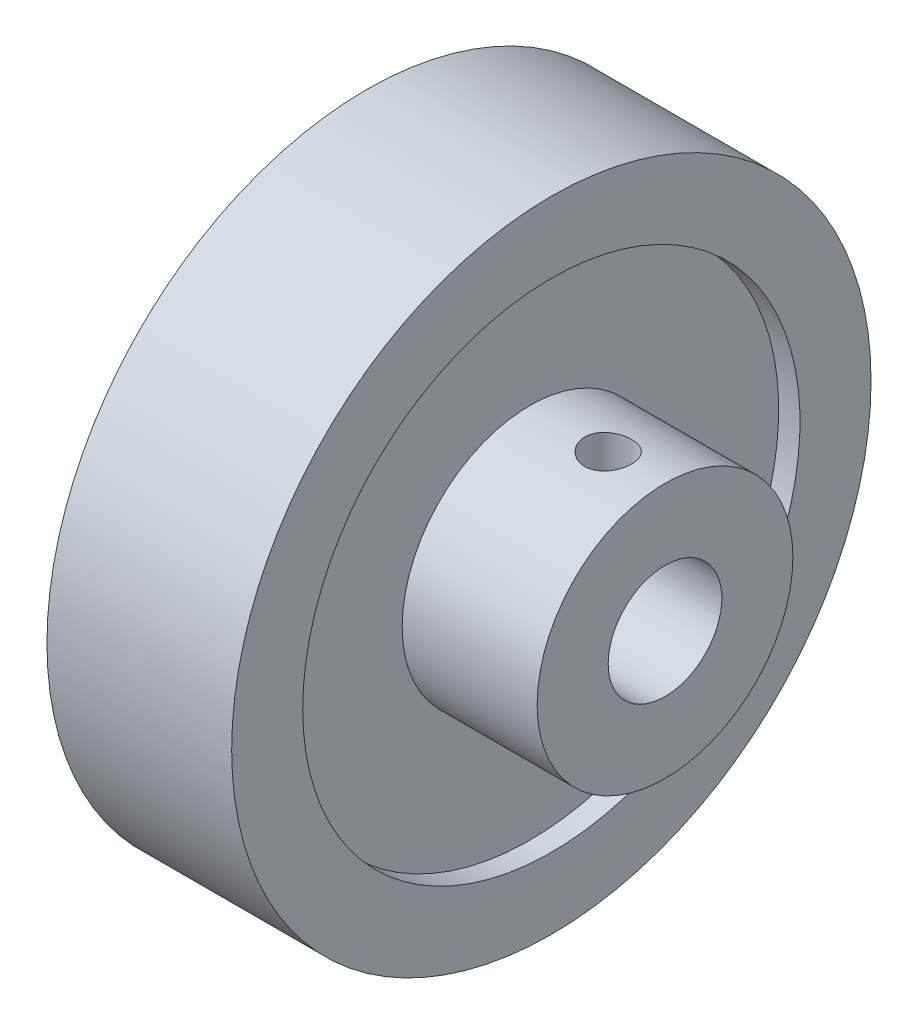
ISO-10303-21;
HEADER;
FILE_DESCRIPTION(('STEP AP214'),'2;1');
FILE_NAME('part.step','',(''),(''),'','','');
FILE_SCHEMA(('AUTOMOTIVE_DESIGN { 1 0 10303 214 1 1 1 1 }'));
ENDSEC;
DATA;
#1=APPLICATION_CONTEXT('core data for automotive mechanical design processes');
#2=APPLICATION_PROTOCOL_DEFINITION('international standard','automotive_design',2000,#1);
#3=PRODUCT_CONTEXT('',#1,'mechanical');
#4=PRODUCT('Part','Part','',(#3));
#5=PRODUCT_RELATED_PRODUCT_CATEGORY('part','',(#4));
#6=PRODUCT_DEFINITION_FORMATION('','',#4);
#7=PRODUCT_DEFINITION_CONTEXT('part definition',#1,'design');
#8=PRODUCT_DEFINITION('design','',#6,#7);
#9=PRODUCT_DEFINITION_SHAPE('','',#8);
#10=(LENGTH_UNIT() NAMED_UNIT(*) SI_UNIT(.MILLI.,.METRE.));
#11=(NAMED_UNIT(*) PLANE_ANGLE_UNIT() SI_UNIT($,.RADIAN.));
#12=(NAMED_UNIT(*) SI_UNIT($,.STERADIAN.) SOLID_ANGLE_UNIT());
#13=UNCERTAINTY_MEASURE_WITH_UNIT(LENGTH_MEASURE(1.E-05),#10,'distance_accuracy_value','');
#14=(GEOMETRIC_REPRESENTATION_CONTEXT(3) GLOBAL_UNCERTAINTY_ASSIGNED_CONTEXT((#13)) GLOBAL_UNIT_ASSIGNED_CONTEXT((#10,
#11,#12)) REPRESENTATION_CONTEXT('',''));
#15=CARTESIAN_POINT('',(0.,0.,0.));
#16=DIRECTION('',(0.,0.,1.));
#17=DIRECTION('',(1.,0.,0.));
#18=AXIS2_PLACEMENT_3D('',#15,#16,#17);
#19=CARTESIAN_POINT('',(14.5,0.,0.));
#20=DIRECTION('',(1.,0.,0.));
#21=DIRECTION('',(0.,0.,-1.));
#22=AXIS2_PLACEMENT_3D('',#19,#20,#21);
#23=PLANE('',#22);
#24=CARTESIAN_POINT('',(14.5,0.,0.));
#25=DIRECTION('',(-1.,0.,0.));
#26=DIRECTION('',(0.,0.,1.));
#27=AXIS2_PLACEMENT_3D('',#24,#25,#26);
#28=CIRCLE('',#27,4.);
#29=CARTESIAN_POINT('',(14.5,0.,4.));
#30=VERTEX_POINT('',#29);
#31=EDGE_CURVE('E10',#30,#30,#28,.T.);
#32=ORIENTED_EDGE('',*,*,#31,.T.);
#33=EDGE_LOOP('',(#32));
#34=FACE_BOUND('',#33,.T.);
#35=CARTESIAN_POINT('',(14.5,0.,0.));
#36=DIRECTION('',(-1.,0.,0.));
#37=DIRECTION('',(0.,0.,1.));
#38=AXIS2_PLACEMENT_3D('',#35,#36,#37);
#39=CIRCLE('',#38,9.);
#40=CARTESIAN_POINT('',(14.5,0.,9.));
#41=VERTEX_POINT('',#40);
#42=EDGE_CURVE('E45',#41,#41,#39,.T.);
#43=ORIENTED_EDGE('',*,*,#42,.F.);
#44=EDGE_LOOP('',(#43));
#45=FACE_BOUND('',#44,.T.);
#46=ADVANCED_FACE('F37',(#34,#45),#23,.T.);
#47=CARTESIAN_POINT('',(0.,0.,0.));
#48=DIRECTION('',(-1.,0.,0.));
#49=DIRECTION('',(0.,0.,1.));
#50=AXIS2_PLACEMENT_3D('',#47,#48,#49);
#51=CYLINDRICAL_SURFACE('',#50,4.);
#52=CARTESIAN_POINT('',(10.5,3.64383040220041,1.65));
#53=CARTESIAN_POINT('',(10.4119035197743,3.64383945275153,1.64999056813102));
#54=CARTESIAN_POINT('',(10.3236595680264,3.64707173267573,1.64289989177358));
#55=CARTESIAN_POINT('',(10.1497129389211,3.65959209124688,1.61480845546373));
#56=CARTESIAN_POINT('',(10.0640178994024,3.66889676295874,1.5937695789634));
#57=CARTESIAN_POINT('',(9.89799706186937,3.69231325052125,1.53873536249638));
#58=CARTESIAN_POINT('',(9.8176511797814,3.70640571161012,1.50479212400174));
#59=CARTESIAN_POINT('',(9.66381823316577,3.73778230052357,1.42506535594206));
#60=CARTESIAN_POINT('',(9.59032945721596,3.75506562873473,1.37928479159595));
#61=CARTESIAN_POINT('',(9.4477713121535,3.7920553041855,1.27419856290371));
#62=CARTESIAN_POINT('',(9.37917074421979,3.81184277704779,1.2142851824136));
#63=CARTESIAN_POINT('',(9.25264522809124,3.85094363418238,1.08391072165483));
#64=CARTESIAN_POINT('',(9.19472434852778,3.87025683535296,1.01344563996364));
#65=CARTESIAN_POINT('',(9.08882862869813,3.90721575035942,0.860301943593381));
#66=CARTESIAN_POINT('',(9.04137906729384,3.92475616703248,0.77723239011359));
#67=CARTESIAN_POINT('',(8.9613298546783,3.95520283117798,0.603436361875857));
#68=CARTESIAN_POINT('',(8.92872373565344,3.96811109652272,0.512713242513045));
#69=CARTESIAN_POINT('',(8.88097929334377,3.98726403378776,0.331105172304399));
#70=CARTESIAN_POINT('',(8.86503315207677,3.99381564337609,0.240465625184492));
#71=CARTESIAN_POINT('',(8.84845334814483,4.0006306156112,0.0575763551498651));
#72=CARTESIAN_POINT('',(8.84781360467799,4.00089647540932,-0.0346727137709554));
#73=CARTESIAN_POINT('',(8.86143649613659,3.99529224160632,-0.212297380895985));
#74=CARTESIAN_POINT('',(8.8748121837171,3.98978733384658,-0.297754665400397));
#75=CARTESIAN_POINT('',(8.91456881744776,3.97375926025944,-0.465085845235279));
#76=CARTESIAN_POINT('',(8.94095072129068,3.96323572489496,-0.546959476205493));
#77=CARTESIAN_POINT('',(9.00628766172018,3.93798907731603,-0.706295606817229));
#78=CARTESIAN_POINT('',(9.04542798992487,3.92320447216362,-0.78367197976247));
#79=CARTESIAN_POINT('',(9.1349912791866,3.89088763760773,-0.930960489992466));
#80=CARTESIAN_POINT('',(9.1854182005033,3.87335444442336,-1.00086999453932));
#81=CARTESIAN_POINT('',(9.30018823902863,3.83587133640027,-1.13638530947041));
#82=CARTESIAN_POINT('',(9.36525341089873,3.8158381454309,-1.20135746318645));
#83=CARTESIAN_POINT('',(9.50540966632157,3.77653142784555,-1.31973838423493));
#84=CARTESIAN_POINT('',(9.5805044492633,3.75725818494773,-1.37314286572202));
#85=CARTESIAN_POINT('',(9.74159840354731,3.72106607156909,-1.46845339844828));
#86=CARTESIAN_POINT('',(9.82786757169265,3.70424107982558,-1.50994179309277));
#87=CARTESIAN_POINT('',(10.0070466714059,3.67596385006485,-1.57754508127096));
#88=CARTESIAN_POINT('',(10.0999519138738,3.66450786071417,-1.60367071206121));
#89=CARTESIAN_POINT('',(10.283422895185,3.64919091711418,-1.63821320355942));
#90=CARTESIAN_POINT('',(10.3737583011829,3.64489111171831,-1.64765569454682));
#91=CARTESIAN_POINT('',(10.5548056296986,3.64311980380967,-1.65157101672826));
#92=CARTESIAN_POINT('',(10.6455174160593,3.64564601607449,-1.64604885780402));
#93=CARTESIAN_POINT('',(10.8188010090495,3.65678944366161,-1.62112710501826));
#94=CARTESIAN_POINT('',(10.9015281796746,3.66501803861665,-1.60261202118543));
#95=CARTESIAN_POINT('',(11.06263706438,3.68614612916707,-1.55339580262015));
#96=CARTESIAN_POINT('',(11.1410177713517,3.69904670212356,-1.52269185697123));
#97=CARTESIAN_POINT('',(11.2948790056956,3.72872477858182,-1.44853902204985));
#98=CARTESIAN_POINT('',(11.3701001947792,3.74564214050945,-1.40460979308264));
#99=CARTESIAN_POINT('',(11.5124601694297,3.78124523189864,-1.30573455409451));
#100=CARTESIAN_POINT('',(11.5795954877351,3.79993171387674,-1.25078384473683));
#101=CARTESIAN_POINT('',(11.7094296264467,3.83876011670653,-1.12627542162099));
#102=CARTESIAN_POINT('',(11.7713517370487,3.85889967217623,-1.05590387126704));
#103=CARTESIAN_POINT('',(11.8826428556621,3.89698114804694,-0.905297980080104));
#104=CARTESIAN_POINT('',(11.9320110520032,3.91492292631236,-0.825063002026905));
#105=CARTESIAN_POINT('',(12.0167041342068,3.94668767391886,-0.656516816883269));
#106=CARTESIAN_POINT('',(12.0520034750027,3.96050313975064,-0.568191273870493));
#107=CARTESIAN_POINT('',(12.1069916568587,3.98237104121022,-0.386140833605179));
#108=CARTESIAN_POINT('',(12.1266895829389,3.9904268305481,-0.292419112817563));
#109=CARTESIAN_POINT('',(12.1487882289205,3.9994889299446,-0.109187189544838));
#110=CARTESIAN_POINT('',(12.1522848287419,4.00094173424749,-0.0198303081186377));
#111=CARTESIAN_POINT('',(12.1448145656297,3.99786220239438,0.158161739195409));
#112=CARTESIAN_POINT('',(12.1338501500045,3.99333087896147,0.246797024648478));
#113=CARTESIAN_POINT('',(12.0985553578644,3.979024148364,0.417705375935874));
#114=CARTESIAN_POINT('',(12.0746955578854,3.96943363922013,0.500092371627849));
#115=CARTESIAN_POINT('',(12.01479588512,3.94605480923816,0.659667355734158));
#116=CARTESIAN_POINT('',(11.9787536752133,3.93226568297163,0.736854343148742));
#117=CARTESIAN_POINT('',(11.8936954733136,3.90105808483759,0.887661133732617));
#118=CARTESIAN_POINT('',(11.8441687432271,3.88350423911689,0.960964214361148));
#119=CARTESIAN_POINT('',(11.73429715321,3.84685709666619,1.09852932170704));
#120=CARTESIAN_POINT('',(11.6739483769192,3.82776324400832,1.1627880603165));
#121=CARTESIAN_POINT('',(11.5394124726453,3.78859741195738,1.28487769945047));
#122=CARTESIAN_POINT('',(11.4645722431151,3.76854475207571,1.34199767947157));
#123=CARTESIAN_POINT('',(11.3057340243189,3.73105419200534,1.4429647467733));
#124=CARTESIAN_POINT('',(11.2217310082904,3.7136177396712,1.48680449811903));
#125=CARTESIAN_POINT('',(11.0472715587301,3.68370387904713,1.55944447766651));
#126=CARTESIAN_POINT('',(10.9568608919089,3.67119480418034,1.58834112875234));
#127=CARTESIAN_POINT('',(10.7719528559216,3.65281837075147,1.63017263567573));
#128=CARTESIAN_POINT('',(10.6774703091231,3.64692873900432,1.64316103312974));
#129=CARTESIAN_POINT('',(10.5551366863574,3.64414054419779,1.6493120932942));
#130=CARTESIAN_POINT('',(10.527575567715,3.64382756923723,1.6500029523216));
#131=CARTESIAN_POINT('',(10.5,3.64383040220041,1.65));
#132=B_SPLINE_CURVE_WITH_KNOTS('',3,(#52,#53,#54,#55,#56,#57,#58,#59,#60,#61,#62,#63,#64,#65,
#66,#67,#68,#69,#70,#71,#72,#73,#74,#75,#76,#77,#78,#79,#80,#81,#82,#83,#84,#85,#86,#87,#88,#89,
#90,#91,#92,#93,#94,#95,#96,#97,#98,#99,#100,#101,#102,#103,#104,#105,#106,#107,#108,#109,#110,
#111,#112,#113,#114,#115,#116,#117,#118,#119,#120,#121,#122,#123,#124,#125,#126,#127,#128,#129,
#130,#131),.UNSPECIFIED.,.T.,.F.,(4,2,2,2,2,2,2,2,2,2,2,2,2,2,2,2,2,2,2,2,2,2,2,2,2,2,2,2,2,2,2,
2,2,2,2,2,2,2,2,4),(0.,0.264211724660743,0.529148459018597,0.793026677872049,1.05683885985756,
1.33523297260792,1.61373292676209,1.90403076094908,2.19420198072699,2.4695381624427,
2.74476495901024,3.00356896819766,3.26239203686791,3.5251552692474,3.78801084539545,
4.06907613148064,4.35024537535724,4.64031806272423,4.9301877724111,5.20152035698263,
5.47276211576042,5.72713321026165,5.9815630002888,6.24665916965708,6.51186861189123,
6.79815687284346,7.08446363898863,7.3712879145617,7.6579450434915,7.92489841526078,
8.19180661499934,8.44957452423758,8.70739191275387,8.97680852354694,9.24632283025306,
9.53374725602174,9.82133016535515,10.1070334851925,10.3917725616094,10.4744749384332),.UNSPECIFIED.);
#133=CARTESIAN_POINT('',(10.5,3.64383040220041,1.65));
#134=VERTEX_POINT('',#133);
#135=EDGE_CURVE('E83',#134,#134,#132,.T.);
#136=ORIENTED_EDGE('',*,*,#135,.F.);
#137=EDGE_LOOP('',(#136));
#138=FACE_BOUND('',#137,.T.);
#139=ORIENTED_EDGE('',*,*,#31,.F.);
#140=EDGE_LOOP('',(#139));
#141=FACE_BOUND('',#140,.T.);
#142=CARTESIAN_POINT('',(-6.5,0.,0.));
#143=DIRECTION('',(-1.,0.,0.));
#144=DIRECTION('',(0.,0.,1.));
#145=AXIS2_PLACEMENT_3D('',#142,#143,#144);
#146=CIRCLE('',#145,4.);
#147=CARTESIAN_POINT('',(-6.5,0.,4.));
#148=VERTEX_POINT('',#147);
#149=EDGE_CURVE('E76',#148,#148,#146,.T.);
#150=ORIENTED_EDGE('',*,*,#149,.T.);
#151=EDGE_LOOP('',(#150));
#152=FACE_BOUND('',#151,.T.);
#153=ADVANCED_FACE('F120',(#138,#141,#152),#51,.F.);
#154=CARTESIAN_POINT('',(0.,0.,0.));
#155=DIRECTION('',(-1.,0.,0.));
#156=DIRECTION('',(0.,0.,1.));
#157=AXIS2_PLACEMENT_3D('',#154,#155,#156);
#158=CYLINDRICAL_SURFACE('',#157,9.);
#159=CARTESIAN_POINT('',(10.5,8.84745726183518,1.65));
#160=CARTESIAN_POINT('',(10.4081582831937,8.84745901892198,1.6499964394224));
#161=CARTESIAN_POINT('',(10.3162699271377,8.84890283987554,1.64230590157074));
#162=CARTESIAN_POINT('',(10.1350815637251,8.85451533715862,1.61176613714486));
#163=CARTESIAN_POINT('',(10.0457838615985,8.85868636698503,1.5889038175375));
#164=CARTESIAN_POINT('',(9.87242477431806,8.8692653634472,1.52874392633965));
#165=CARTESIAN_POINT('',(9.78835869743117,8.87567129073683,1.49145951156419));
#166=CARTESIAN_POINT('',(9.62768103383324,8.88999588322384,1.40354823742994));
#167=CARTESIAN_POINT('',(9.55106881280661,8.89791441952949,1.35292251476509));
#168=CARTESIAN_POINT('',(9.40655525337157,8.91447729782654,1.23912329573546));
#169=CARTESIAN_POINT('',(9.33875552157369,8.9231284793793,1.17582174562027));
#170=CARTESIAN_POINT('',(9.21467622886251,8.94012139859551,1.0387445325282));
#171=CARTESIAN_POINT('',(9.15839740843146,8.94846311634063,0.964968196822379));
#172=CARTESIAN_POINT('',(9.05856976057367,8.96397031660692,0.808370094208623));
#173=CARTESIAN_POINT('',(9.01511648163295,8.97112680443415,0.725486450457435));
#174=CARTESIAN_POINT('',(8.94278868047214,8.98338073561933,0.553442397265329));
#175=CARTESIAN_POINT('',(8.91391301236632,8.98847834081121,0.464282481804159));
#176=CARTESIAN_POINT('',(8.87187360376038,8.99599184044781,0.283269124287475));
#177=CARTESIAN_POINT('',(8.85853868422578,8.99843693079941,0.191456669505486));
#178=CARTESIAN_POINT('',(8.84742615829295,9.0004704699038,0.00686726123056545));
#179=CARTESIAN_POINT('',(8.84964728294487,9.00005915166182,-0.0859096129755195));
#180=CARTESIAN_POINT('',(8.86945205072894,8.9964490954066,-0.26862107613076));
#181=CARTESIAN_POINT('',(8.88685139701444,8.99328379793804,-0.358576397674034));
#182=CARTESIAN_POINT('',(8.93622749140059,8.98455889106423,-0.534268634140892));
#183=CARTESIAN_POINT('',(8.96820475330903,8.97899919726735,-0.62000540026082));
#184=CARTESIAN_POINT('',(9.0460061326133,8.96605406715764,-0.785364166009647));
#185=CARTESIAN_POINT('',(9.09190439448689,8.95865889421121,-0.864950487278734));
#186=CARTESIAN_POINT('',(9.19619032658223,8.94286143914684,-1.01536059295368));
#187=CARTESIAN_POINT('',(9.25457921309687,8.93445905898567,-1.0861835229506));
#188=CARTESIAN_POINT('',(9.38320592951834,8.91743323423739,-1.21814777725155));
#189=CARTESIAN_POINT('',(9.45360496701157,8.90880835477524,-1.27913188938372));
#190=CARTESIAN_POINT('',(9.60371532666878,8.89242768228004,-1.38845045398527));
#191=CARTESIAN_POINT('',(9.68342677350334,8.88467190088483,-1.43678473707604));
#192=CARTESIAN_POINT('',(9.85010219519116,8.87090573827501,-1.51947349449105));
#193=CARTESIAN_POINT('',(9.93707733868242,8.86489811106008,-1.55380594446243));
#194=CARTESIAN_POINT('',(10.1156960591932,8.85535127355658,-1.60732704304287));
#195=CARTESIAN_POINT('',(10.2073391311052,8.85181179680058,-1.62651732646586));
#196=CARTESIAN_POINT('',(10.391276948073,8.84765450127231,-1.64898152750405));
#197=CARTESIAN_POINT('',(10.483543245655,8.84699529295657,-1.65248094271885));
#198=CARTESIAN_POINT('',(10.6673420362723,8.84856252229377,-1.64406780282764));
#199=CARTESIAN_POINT('',(10.7588745637128,8.85078882384403,-1.63215597463368));
#200=CARTESIAN_POINT('',(10.9378714586204,8.85783773611537,-1.59345179403482));
#201=CARTESIAN_POINT('',(11.025362111555,8.86263983774371,-1.56677693553147));
#202=CARTESIAN_POINT('',(11.1946320308302,8.87428170227549,-1.4994282586396));
#203=CARTESIAN_POINT('',(11.2764108919525,8.88112160956848,-1.45875344824718));
#204=CARTESIAN_POINT('',(11.4329313778446,8.89616305565477,-1.36403772724192));
#205=CARTESIAN_POINT('',(11.507585148503,8.90437881998151,-1.30985393656712));
#206=CARTESIAN_POINT('',(11.6468223459456,8.92120592930909,-1.18985171572413));
#207=CARTESIAN_POINT('',(11.7114049079273,8.92981730819877,-1.1240322874522));
#208=CARTESIAN_POINT('',(11.8295048972401,8.94659793280905,-0.981621696389441));
#209=CARTESIAN_POINT('',(11.8828709310707,8.95476015110835,-0.904904026593928));
#210=CARTESIAN_POINT('',(11.9759562173543,8.96960574193605,-0.743461022632928));
#211=CARTESIAN_POINT('',(12.0156759787332,8.97628916961134,-0.658735987245476));
#212=CARTESIAN_POINT('',(12.0801127044637,8.98739384933322,-0.484108123906145));
#213=CARTESIAN_POINT('',(12.1049050303524,8.9918264466613,-0.39423385689179));
#214=CARTESIAN_POINT('',(12.1390241190171,8.99797834182,-0.211508393786717));
#215=CARTESIAN_POINT('',(12.1483524344356,8.99969791204747,-0.118657497514627));
#216=CARTESIAN_POINT('',(12.1512266015957,9.00022491498227,0.0659317448621692));
#217=CARTESIAN_POINT('',(12.1450014553555,8.99907460287948,0.157666483588201));
#218=CARTESIAN_POINT('',(12.1174456573151,8.99407857168316,0.338759580424886));
#219=CARTESIAN_POINT('',(12.0961151368421,8.99023287602347,0.428117959188761));
#220=CARTESIAN_POINT('',(12.0390488334187,8.98027777614887,0.601807716590022));
#221=CARTESIAN_POINT('',(12.0033364113336,8.97417204425898,0.686146994099343));
#222=CARTESIAN_POINT('',(11.9185470604056,8.9603589790486,0.847670784442995));
#223=CARTESIAN_POINT('',(11.8694692893221,8.95265154480133,0.92485484596805));
#224=CARTESIAN_POINT('',(11.7585491479819,8.93635291506659,1.07102106627643));
#225=CARTESIAN_POINT('',(11.6965408424628,8.92775104266162,1.13987612682785));
#226=CARTESIAN_POINT('',(11.5618650993429,8.91070173225532,1.26628317842481));
#227=CARTESIAN_POINT('',(11.489195161937,8.90225433099627,1.32383251122359));
#228=CARTESIAN_POINT('',(11.3344963795167,8.88638953245293,1.42646744502769));
#229=CARTESIAN_POINT('',(11.2523909444921,8.87898183283415,1.47143914338883));
#230=CARTESIAN_POINT('',(11.0816824366736,8.8661513535635,1.54687963343648));
#231=CARTESIAN_POINT('',(10.9930856665516,8.86072667839238,1.57736228322634));
#232=CARTESIAN_POINT('',(10.8368408584403,8.8536227559401,1.61667460639905));
#233=CARTESIAN_POINT('',(10.7701145619189,8.85132423978349,1.62915050274741));
#234=CARTESIAN_POINT('',(10.6356006348407,8.84824086306327,1.64581440990914));
#235=CARTESIAN_POINT('',(10.5678130310011,8.84745596445762,1.65000262901835));
#236=CARTESIAN_POINT('',(10.5,8.84745726183518,1.65));
#237=B_SPLINE_CURVE_WITH_KNOTS('',3,(#159,#160,#161,#162,#163,#164,#165,#166,#167,#168,#169,
#170,#171,#172,#173,#174,#175,#176,#177,#178,#179,#180,#181,#182,#183,#184,#185,#186,#187,#188,
#189,#190,#191,#192,#193,#194,#195,#196,#197,#198,#199,#200,#201,#202,#203,#204,#205,#206,#207,
#208,#209,#210,#211,#212,#213,#214,#215,#216,#217,#218,#219,#220,#221,#222,#223,#224,#225,#226,
#227,#228,#229,#230,#231,#232,#233,#234,#235,#236),.UNSPECIFIED.,.T.,.F.,(4,2,2,2,2,2,2,2,2,2,2,
2,2,2,2,2,2,2,2,2,2,2,2,2,2,2,2,2,2,2,2,2,2,2,2,2,2,2,4),(0.,0.275277027247351,
0.550791924145748,0.826056068166021,1.10129676696005,1.37947266842813,1.65766644345527,
1.93788324035369,2.21807800713692,2.49515639448048,2.77221218003152,3.04595000369877,
3.31969747617386,3.59492934730967,3.87018803176225,4.14948338686984,4.4287824814933,
4.70851922412506,4.98822576103179,5.26389940371883,5.53956004400362,5.81305770418116,
6.0865747477553,6.36311747087758,6.63968392732552,6.9197725663118,7.19985075850152,
7.47850284688868,7.7571269559078,8.0316729765667,8.30621661033371,8.58031608354243,
8.85443283360044,9.13231150460448,9.41025543353243,9.69064042578676,9.97075670045882,
10.1740176957909,10.3772735824592),.UNSPECIFIED.);
#238=CARTESIAN_POINT('',(10.5,8.84745726183518,1.65));
#239=VERTEX_POINT('',#238);
#240=EDGE_CURVE('E78',#239,#239,#237,.T.);
#241=ORIENTED_EDGE('',*,*,#240,.T.);
#242=EDGE_LOOP('',(#241));
#243=FACE_BOUND('',#242,.T.);
#244=ORIENTED_EDGE('',*,*,#42,.T.);
#245=EDGE_LOOP('',(#244));
#246=FACE_BOUND('',#245,.T.);
#247=CARTESIAN_POINT('',(5.,0.,0.));
#248=DIRECTION('',(-1.,0.,0.));
#249=DIRECTION('',(0.,0.,1.));
#250=AXIS2_PLACEMENT_3D('',#247,#248,#249);
#251=CIRCLE('',#250,9.);
#252=CARTESIAN_POINT('',(5.,0.,9.));
#253=VERTEX_POINT('',#252);
#254=EDGE_CURVE('E72',#253,#253,#251,.T.);
#255=ORIENTED_EDGE('',*,*,#254,.F.);
#256=EDGE_LOOP('',(#255));
#257=FACE_BOUND('',#256,.T.);
#258=ADVANCED_FACE('F97',(#243,#246,#257),#158,.T.);
#259=CARTESIAN_POINT('',(-6.5,17.5,0.));
#260=DIRECTION('',(-1.,0.,0.));
#261=DIRECTION('',(0.,0.,1.));
#262=AXIS2_PLACEMENT_3D('',#259,#260,#261);
#263=PLANE('',#262);
#264=CARTESIAN_POINT('',(-6.5,0.,0.));
#265=DIRECTION('',(-1.,0.,0.));
#266=DIRECTION('',(0.,0.,1.));
#267=AXIS2_PLACEMENT_3D('',#264,#265,#266);
#268=CIRCLE('',#267,22.5);
#269=CARTESIAN_POINT('',(-6.5,0.,22.5));
#270=VERTEX_POINT('',#269);
#271=EDGE_CURVE('E64',#270,#270,#268,.T.);
#272=ORIENTED_EDGE('',*,*,#271,.T.);
#273=EDGE_LOOP('',(#272));
#274=FACE_BOUND('',#273,.T.);
#275=CARTESIAN_POINT('',(-6.5,0.,0.));
#276=DIRECTION('',(-1.,0.,0.));
#277=DIRECTION('',(0.,0.,1.));
#278=AXIS2_PLACEMENT_3D('',#275,#276,#277);
#279=CIRCLE('',#278,17.5);
#280=CARTESIAN_POINT('',(-6.5,0.,17.5));
#281=VERTEX_POINT('',#280);
#282=EDGE_CURVE('E61',#281,#281,#279,.T.);
#283=ORIENTED_EDGE('',*,*,#282,.F.);
#284=EDGE_LOOP('',(#283));
#285=FACE_BOUND('',#284,.T.);
#286=ADVANCED_FACE('F135',(#274,#285),#263,.T.);
#287=CARTESIAN_POINT('',(0.,0.,0.));
#288=DIRECTION('',(-1.,0.,0.));
#289=DIRECTION('',(0.,0.,1.));
#290=AXIS2_PLACEMENT_3D('',#287,#288,#289);
#291=CYLINDRICAL_SURFACE('',#290,17.5);
#292=CARTESIAN_POINT('',(-5.,0.,0.));
#293=DIRECTION('',(-1.,0.,0.));
#294=DIRECTION('',(0.,0.,1.));
#295=AXIS2_PLACEMENT_3D('',#292,#293,#294);
#296=CIRCLE('',#295,17.5);
#297=CARTESIAN_POINT('',(-5.,0.,17.5));
#298=VERTEX_POINT('',#297);
#299=EDGE_CURVE('E67',#298,#298,#296,.F.);
#300=ORIENTED_EDGE('',*,*,#299,.T.);
#301=EDGE_LOOP('',(#300));
#302=FACE_BOUND('',#301,.T.);
#303=ORIENTED_EDGE('',*,*,#282,.T.);
#304=EDGE_LOOP('',(#303));
#305=FACE_BOUND('',#304,.T.);
#306=ADVANCED_FACE('F132',(#302,#305),#291,.F.);
#307=CARTESIAN_POINT('',(-5.,9.,0.));
#308=DIRECTION('',(-1.,0.,0.));
#309=DIRECTION('',(0.,0.,1.));
#310=AXIS2_PLACEMENT_3D('',#307,#308,#309);
#311=PLANE('',#310);
#312=ORIENTED_EDGE('',*,*,#299,.F.);
#313=EDGE_LOOP('',(#312));
#314=FACE_BOUND('',#313,.T.);
#315=CARTESIAN_POINT('',(-5.,0.,0.));
#316=DIRECTION('',(-1.,0.,0.));
#317=DIRECTION('',(0.,0.,1.));
#318=AXIS2_PLACEMENT_3D('',#315,#316,#317);
#319=CIRCLE('',#318,9.);
#320=CARTESIAN_POINT('',(-5.,0.,9.));
#321=VERTEX_POINT('',#320);
#322=EDGE_CURVE('E58',#321,#321,#319,.T.);
#323=ORIENTED_EDGE('',*,*,#322,.F.);
#324=EDGE_LOOP('',(#323));
#325=FACE_BOUND('',#324,.T.);
#326=ADVANCED_FACE('F114',(#314,#325),#311,.T.);
#327=CARTESIAN_POINT('',(0.,0.,0.));
#328=DIRECTION('',(-1.,0.,0.));
#329=DIRECTION('',(0.,0.,1.));
#330=AXIS2_PLACEMENT_3D('',#327,#328,#329);
#331=CYLINDRICAL_SURFACE('',#330,9.);
#332=ORIENTED_EDGE('',*,*,#322,.T.);
#333=EDGE_LOOP('',(#332));
#334=FACE_BOUND('',#333,.T.);
#335=CARTESIAN_POINT('',(-6.5,0.,0.));
#336=DIRECTION('',(-1.,0.,0.));
#337=DIRECTION('',(0.,0.,1.));
#338=AXIS2_PLACEMENT_3D('',#335,#336,#337);
#339=CIRCLE('',#338,9.);
#340=CARTESIAN_POINT('',(-6.5,0.,9.));
#341=VERTEX_POINT('',#340);
#342=EDGE_CURVE('E41',#341,#341,#339,.T.);
#343=ORIENTED_EDGE('',*,*,#342,.F.);
#344=EDGE_LOOP('',(#343));
#345=FACE_BOUND('',#344,.T.);
#346=ADVANCED_FACE('F39',(#334,#345),#331,.T.);
#347=CARTESIAN_POINT('',(-6.5,4.,0.));
#348=DIRECTION('',(-1.,0.,0.));
#349=DIRECTION('',(0.,0.,1.));
#350=AXIS2_PLACEMENT_3D('',#347,#348,#349);
#351=PLANE('',#350);
#352=ORIENTED_EDGE('',*,*,#342,.T.);
#353=EDGE_LOOP('',(#352));
#354=FACE_BOUND('',#353,.T.);
#355=ORIENTED_EDGE('',*,*,#149,.F.);
#356=EDGE_LOOP('',(#355));
#357=FACE_BOUND('',#356,.T.);
#358=ADVANCED_FACE('F105',(#354,#357),#351,.T.);
#359=CARTESIAN_POINT('',(0.,0.,0.));
#360=DIRECTION('',(-1.,0.,0.));
#361=DIRECTION('',(0.,0.,1.));
#362=AXIS2_PLACEMENT_3D('',#359,#360,#361);
#363=CYLINDRICAL_SURFACE('',#362,22.5);
#364=CARTESIAN_POINT('',(6.5,0.,0.));
#365=DIRECTION('',(-1.,0.,0.));
#366=DIRECTION('',(0.,0.,1.));
#367=AXIS2_PLACEMENT_3D('',#364,#365,#366);
#368=CIRCLE('',#367,22.5);
#369=CARTESIAN_POINT('',(6.5,0.,22.5));
#370=VERTEX_POINT('',#369);
#371=EDGE_CURVE('E54',#370,#370,#368,.T.);
#372=ORIENTED_EDGE('',*,*,#371,.T.);
#373=EDGE_LOOP('',(#372));
#374=FACE_BOUND('',#373,.T.);
#375=ORIENTED_EDGE('',*,*,#271,.F.);
#376=EDGE_LOOP('',(#375));
#377=FACE_BOUND('',#376,.T.);
#378=ADVANCED_FACE('F117',(#374,#377),#363,.T.);
#379=CARTESIAN_POINT('',(6.5,17.5,0.));
#380=DIRECTION('',(-1.,0.,0.));
#381=DIRECTION('',(0.,0.,1.));
#382=AXIS2_PLACEMENT_3D('',#379,#380,#381);
#383=PLANE('',#382);
#384=ORIENTED_EDGE('',*,*,#371,.F.);
#385=EDGE_LOOP('',(#384));
#386=FACE_BOUND('',#385,.T.);
#387=CARTESIAN_POINT('',(6.5,0.,0.));
#388=DIRECTION('',(-1.,0.,0.));
#389=DIRECTION('',(0.,0.,1.));
#390=AXIS2_PLACEMENT_3D('',#387,#388,#389);
#391=CIRCLE('',#390,17.5);
#392=CARTESIAN_POINT('',(6.5,0.,17.5));
#393=VERTEX_POINT('',#392);
#394=EDGE_CURVE('E57',#393,#393,#391,.T.);
#395=ORIENTED_EDGE('',*,*,#394,.T.);
#396=EDGE_LOOP('',(#395));
#397=FACE_BOUND('',#396,.T.);
#398=ADVANCED_FACE('F128',(#386,#397),#383,.F.);
#399=ORIENTED_EDGE('',*,*,#394,.F.);
#400=EDGE_LOOP('',(#399));
#401=FACE_BOUND('',#400,.T.);
#402=CARTESIAN_POINT('',(5.,0.,0.));
#403=DIRECTION('',(-1.,0.,0.));
#404=DIRECTION('',(0.,0.,1.));
#405=AXIS2_PLACEMENT_3D('',#402,#403,#404);
#406=CIRCLE('',#405,17.5);
#407=CARTESIAN_POINT('',(5.,0.,17.5));
#408=VERTEX_POINT('',#407);
#409=EDGE_CURVE('E50',#408,#408,#406,.F.);
#410=ORIENTED_EDGE('',*,*,#409,.F.);
#411=EDGE_LOOP('',(#410));
#412=FACE_BOUND('',#411,.T.);
#413=ADVANCED_FACE('F111',(#401,#412),#291,.F.);
#414=CARTESIAN_POINT('',(5.,9.,0.));
#415=DIRECTION('',(-1.,0.,0.));
#416=DIRECTION('',(0.,0.,1.));
#417=AXIS2_PLACEMENT_3D('',#414,#415,#416);
#418=PLANE('',#417);
#419=ORIENTED_EDGE('',*,*,#409,.T.);
#420=EDGE_LOOP('',(#419));
#421=FACE_BOUND('',#420,.T.);
#422=ORIENTED_EDGE('',*,*,#254,.T.);
#423=EDGE_LOOP('',(#422));
#424=FACE_BOUND('',#423,.T.);
#425=ADVANCED_FACE('F103',(#421,#424),#418,.F.);
#426=CARTESIAN_POINT('',(10.5,9.,0.));
#427=DIRECTION('',(0.,1.,0.));
#428=DIRECTION('',(0.,0.,1.));
#429=AXIS2_PLACEMENT_3D('',#426,#427,#428);
#430=CYLINDRICAL_SURFACE('',#429,1.65);
#431=ORIENTED_EDGE('',*,*,#135,.T.);
#432=EDGE_LOOP('',(#431));
#433=FACE_BOUND('',#432,.T.);
#434=ORIENTED_EDGE('',*,*,#240,.F.);
#435=EDGE_LOOP('',(#434));
#436=FACE_BOUND('',#435,.T.);
#437=ADVANCED_FACE('F100',(#433,#436),#430,.F.);
#438=CLOSED_SHELL('',(#46,#153,#258,#286,#306,#326,#346,#358,#378,#398,#413,#425,#437));
#439=MANIFOLD_SOLID_BREP('B2',#438);
#440=ADVANCED_BREP_SHAPE_REPRESENTATION('',(#18,#439),#14);
#441=SHAPE_DEFINITION_REPRESENTATION(#9,#440);
ENDSEC;
END-ISO-10303-21;
